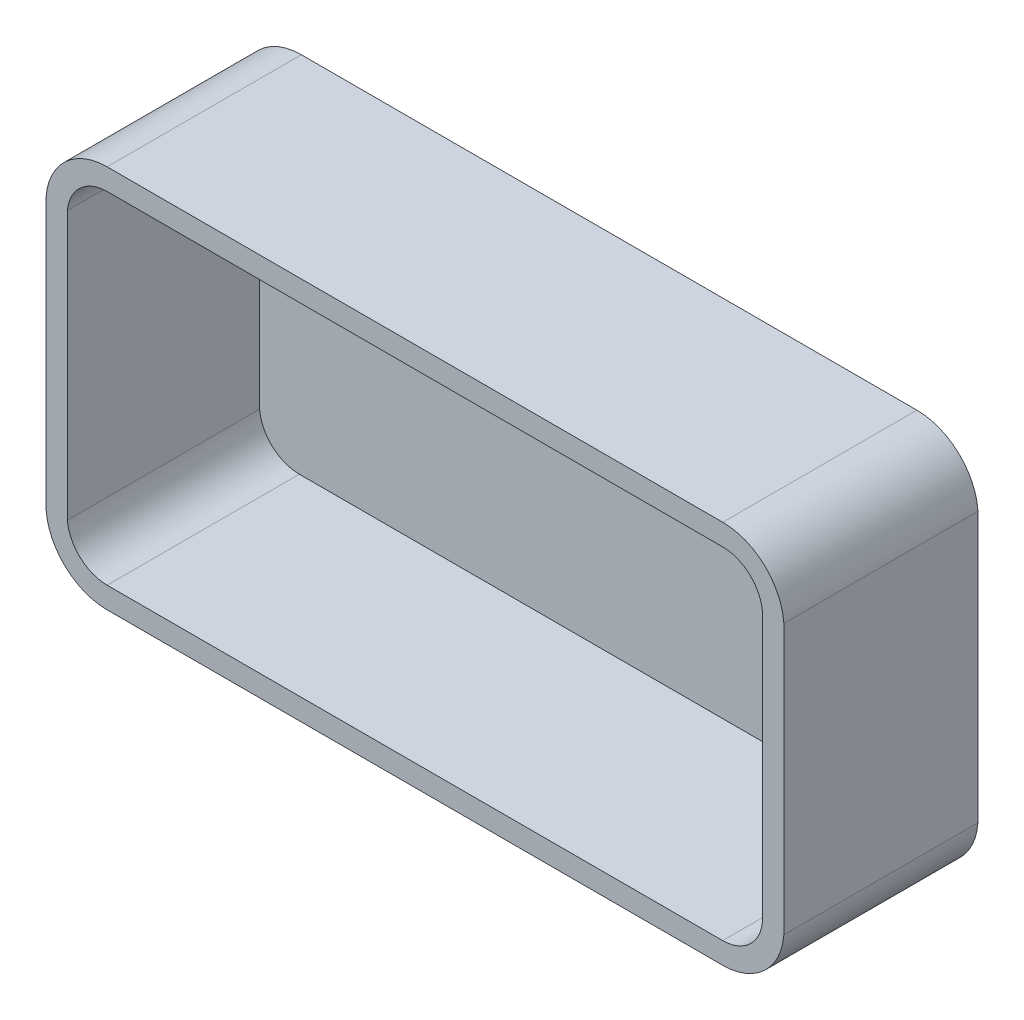
ISO-10303-21;
HEADER;
FILE_DESCRIPTION(('STEP AP214'),'2;1');
FILE_NAME('part.step','',(''),(''),'','','');
FILE_SCHEMA(('AUTOMOTIVE_DESIGN { 1 0 10303 214 1 1 1 1 }'));
ENDSEC;
DATA;
#1=APPLICATION_CONTEXT('core data for automotive mechanical design processes');
#2=APPLICATION_PROTOCOL_DEFINITION('international standard','automotive_design',2000,#1);
#3=PRODUCT_CONTEXT('',#1,'mechanical');
#4=PRODUCT('Part','Part','',(#3));
#5=PRODUCT_RELATED_PRODUCT_CATEGORY('part','',(#4));
#6=PRODUCT_DEFINITION_FORMATION('','',#4);
#7=PRODUCT_DEFINITION_CONTEXT('part definition',#1,'design');
#8=PRODUCT_DEFINITION('design','',#6,#7);
#9=PRODUCT_DEFINITION_SHAPE('','',#8);
#10=(LENGTH_UNIT() NAMED_UNIT(*) SI_UNIT(.MILLI.,.METRE.));
#11=(NAMED_UNIT(*) PLANE_ANGLE_UNIT() SI_UNIT($,.RADIAN.));
#12=(NAMED_UNIT(*) SI_UNIT($,.STERADIAN.) SOLID_ANGLE_UNIT());
#13=UNCERTAINTY_MEASURE_WITH_UNIT(LENGTH_MEASURE(1.E-05),#10,'distance_accuracy_value','');
#14=(GEOMETRIC_REPRESENTATION_CONTEXT(3) GLOBAL_UNCERTAINTY_ASSIGNED_CONTEXT((#13)) GLOBAL_UNIT_ASSIGNED_CONTEXT((#10,
#11,#12)) REPRESENTATION_CONTEXT('',''));
#15=CARTESIAN_POINT('',(0.,0.,0.));
#16=DIRECTION('',(0.,0.,1.));
#17=DIRECTION('',(1.,0.,0.));
#18=AXIS2_PLACEMENT_3D('',#15,#16,#17);
#19=CARTESIAN_POINT('',(5219.30963149017,315.598663005318,1000.));
#20=DIRECTION('',(0.,0.,-1.));
#21=DIRECTION('',(-1.,0.,0.));
#22=AXIS2_PLACEMENT_3D('',#19,#20,#21);
#23=PLANE('',#22);
#24=CARTESIAN_POINT('',(5219.30963149017,315.598663005318,1000.));
#25=DIRECTION('',(0.,0.,1.));
#26=DIRECTION('',(-1.,0.,0.));
#27=AXIS2_PLACEMENT_3D('',#24,#25,#26);
#28=CIRCLE('',#27,315.598663005312);
#29=CARTESIAN_POINT('',(4904.50700095543,293.197326010624,1000.));
#30=VERTEX_POINT('',#29);
#31=CARTESIAN_POINT('',(5219.30963149017,5.77315972805081E-12,1000.));
#32=VERTEX_POINT('',#31);
#33=EDGE_CURVE('E218',#30,#32,#28,.T.);
#34=ORIENTED_EDGE('',*,*,#33,.T.);
#35=DIRECTION('',(1.,0.,0.));
#36=VECTOR('',#35,1.);
#37=CARTESIAN_POINT('',(5219.30963149017,5.77315972805081E-12,1000.));
#38=LINE('',#37,#36);
#39=CARTESIAN_POINT('',(8389.70437042069,0.,1000.));
#40=VERTEX_POINT('',#39);
#41=EDGE_CURVE('E221',#32,#40,#38,.T.);
#42=ORIENTED_EDGE('',*,*,#41,.T.);
#43=CARTESIAN_POINT('',(8389.70437042069,315.598663005312,1000.));
#44=DIRECTION('',(0.,0.,1.));
#45=DIRECTION('',(1.,0.,0.));
#46=AXIS2_PLACEMENT_3D('',#43,#44,#45);
#47=CIRCLE('',#46,315.598663005312);
#48=CARTESIAN_POINT('',(8704.50700095543,293.197326010618,1000.));
#49=VERTEX_POINT('',#48);
#50=EDGE_CURVE('E224',#40,#49,#47,.T.);
#51=ORIENTED_EDGE('',*,*,#50,.T.);
#52=DIRECTION('',(0.,1.,0.));
#53=VECTOR('',#52,1.);
#54=CARTESIAN_POINT('',(8704.50700095543,1682.80267398938,1000.));
#55=LINE('',#54,#53);
#56=CARTESIAN_POINT('',(8704.50700095543,1682.80267398938,1000.));
#57=VERTEX_POINT('',#56);
#58=EDGE_CURVE('E226',#49,#57,#55,.T.);
#59=ORIENTED_EDGE('',*,*,#58,.T.);
#60=CARTESIAN_POINT('',(8389.70437042069,1660.40133699469,1000.));
#61=DIRECTION('',(0.,0.,1.));
#62=DIRECTION('',(-1.,0.,0.));
#63=AXIS2_PLACEMENT_3D('',#60,#61,#62);
#64=CIRCLE('',#63,315.598663005312);
#65=CARTESIAN_POINT('',(8389.70437042069,1976.,1000.));
#66=VERTEX_POINT('',#65);
#67=EDGE_CURVE('E228',#57,#66,#64,.T.);
#68=ORIENTED_EDGE('',*,*,#67,.T.);
#69=DIRECTION('',(-1.,0.,0.));
#70=VECTOR('',#69,1.);
#71=CARTESIAN_POINT('',(5219.30963149017,1976.00000000001,1000.));
#72=LINE('',#71,#70);
#73=CARTESIAN_POINT('',(5219.30963149017,1976.00000000001,1000.));
#74=VERTEX_POINT('',#73);
#75=EDGE_CURVE('E230',#66,#74,#72,.T.);
#76=ORIENTED_EDGE('',*,*,#75,.T.);
#77=CARTESIAN_POINT('',(5219.30963149017,1660.40133699469,1000.));
#78=DIRECTION('',(0.,0.,1.));
#79=DIRECTION('',(1.,0.,0.));
#80=AXIS2_PLACEMENT_3D('',#77,#78,#79);
#81=CIRCLE('',#80,315.598663005312);
#82=CARTESIAN_POINT('',(4904.50700095543,1682.80267398939,1000.));
#83=VERTEX_POINT('',#82);
#84=EDGE_CURVE('E232',#74,#83,#81,.T.);
#85=ORIENTED_EDGE('',*,*,#84,.T.);
#86=DIRECTION('',(0.,-1.,0.));
#87=VECTOR('',#86,1.);
#88=CARTESIAN_POINT('',(4904.50700095543,1682.80267398939,1000.));
#89=LINE('',#88,#87);
#90=EDGE_CURVE('E234',#83,#30,#89,.T.);
#91=ORIENTED_EDGE('',*,*,#90,.T.);
#92=EDGE_LOOP('',(#34,#42,#51,#59,#68,#76,#85,#91));
#93=FACE_BOUND('',#92,.T.);
#94=CARTESIAN_POINT('',(5219.30963149017,315.598663005318,1000.));
#95=DIRECTION('',(0.,0.,1.));
#96=DIRECTION('',(-1.,0.,0.));
#97=AXIS2_PLACEMENT_3D('',#94,#95,#96);
#98=CIRCLE('',#97,205.598663005312);
#99=CARTESIAN_POINT('',(5014.50700095543,297.524019008111,1000.));
#100=VERTEX_POINT('',#99);
#101=CARTESIAN_POINT('',(5219.30963149017,110.000000000006,1000.));
#102=VERTEX_POINT('',#101);
#103=EDGE_CURVE('E167',#100,#102,#98,.T.);
#104=ORIENTED_EDGE('',*,*,#103,.F.);
#105=DIRECTION('',(0.,-1.,0.));
#106=VECTOR('',#105,1.);
#107=CARTESIAN_POINT('',(5014.50700095543,1678.47598099185,1000.));
#108=LINE('',#107,#106);
#109=CARTESIAN_POINT('',(5014.50700095543,1678.47598099185,1000.));
#110=VERTEX_POINT('',#109);
#111=EDGE_CURVE('E157',#110,#100,#108,.T.);
#112=ORIENTED_EDGE('',*,*,#111,.F.);
#113=CARTESIAN_POINT('',(5219.30963149017,1660.40133699469,1000.));
#114=DIRECTION('',(0.,0.,1.));
#115=DIRECTION('',(1.,0.,0.));
#116=AXIS2_PLACEMENT_3D('',#113,#114,#115);
#117=CIRCLE('',#116,205.598663005312);
#118=CARTESIAN_POINT('',(5219.30963149017,1866.00000000001,1000.));
#119=VERTEX_POINT('',#118);
#120=EDGE_CURVE('E199',#119,#110,#117,.T.);
#121=ORIENTED_EDGE('',*,*,#120,.F.);
#122=DIRECTION('',(-1.,0.,0.));
#123=VECTOR('',#122,1.);
#124=CARTESIAN_POINT('',(5219.30963149017,1866.00000000001,1000.));
#125=LINE('',#124,#123);
#126=CARTESIAN_POINT('',(8389.70437042069,1866.,1000.));
#127=VERTEX_POINT('',#126);
#128=EDGE_CURVE('E197',#127,#119,#125,.T.);
#129=ORIENTED_EDGE('',*,*,#128,.F.);
#130=CARTESIAN_POINT('',(8389.70437042069,1660.40133699469,1000.));
#131=DIRECTION('',(0.,0.,1.));
#132=DIRECTION('',(-1.,0.,0.));
#133=AXIS2_PLACEMENT_3D('',#130,#131,#132);
#134=CIRCLE('',#133,205.598663005312);
#135=CARTESIAN_POINT('',(8594.50700095543,1678.47598099183,1000.));
#136=VERTEX_POINT('',#135);
#137=EDGE_CURVE('E195',#136,#127,#134,.T.);
#138=ORIENTED_EDGE('',*,*,#137,.F.);
#139=DIRECTION('',(0.,1.,0.));
#140=VECTOR('',#139,1.);
#141=CARTESIAN_POINT('',(8594.50700095543,1678.47598099183,1000.));
#142=LINE('',#141,#140);
#143=CARTESIAN_POINT('',(8594.50700095543,297.524019008171,1000.));
#144=VERTEX_POINT('',#143);
#145=EDGE_CURVE('E193',#144,#136,#142,.T.);
#146=ORIENTED_EDGE('',*,*,#145,.F.);
#147=CARTESIAN_POINT('',(8389.70437042069,315.598663005312,1000.));
#148=DIRECTION('',(0.,0.,1.));
#149=DIRECTION('',(1.,0.,0.));
#150=AXIS2_PLACEMENT_3D('',#147,#148,#149);
#151=CIRCLE('',#150,205.598663005309);
#152=CARTESIAN_POINT('',(8389.70437042069,110.000000000006,1000.));
#153=VERTEX_POINT('',#152);
#154=EDGE_CURVE('E191',#153,#144,#151,.T.);
#155=ORIENTED_EDGE('',*,*,#154,.F.);
#156=DIRECTION('',(1.,0.,0.));
#157=VECTOR('',#156,1.);
#158=CARTESIAN_POINT('',(5219.30963149017,110.000000000006,1000.));
#159=LINE('',#158,#157);
#160=EDGE_CURVE('E189',#102,#153,#159,.T.);
#161=ORIENTED_EDGE('',*,*,#160,.F.);
#162=EDGE_LOOP('',(#104,#112,#121,#129,#138,#146,#155,#161));
#163=FACE_BOUND('',#162,.T.);
#164=ADVANCED_FACE('F37',(#93,#163),#23,.F.);
#165=CARTESIAN_POINT('',(5219.30963149017,315.598663005318,0.));
#166=DIRECTION('',(0.,0.,-1.));
#167=DIRECTION('',(-1.,0.,0.));
#168=AXIS2_PLACEMENT_3D('',#165,#166,#167);
#169=PLANE('',#168);
#170=CARTESIAN_POINT('',(5219.30963149017,315.598663005318,0.));
#171=DIRECTION('',(0.,0.,1.));
#172=DIRECTION('',(-1.,0.,0.));
#173=AXIS2_PLACEMENT_3D('',#170,#171,#172);
#174=CIRCLE('',#173,315.598663005312);
#175=CARTESIAN_POINT('',(4904.50700095543,293.197326010624,0.));
#176=VERTEX_POINT('',#175);
#177=CARTESIAN_POINT('',(5219.30963149017,5.77315972805081E-12,0.));
#178=VERTEX_POINT('',#177);
#179=EDGE_CURVE('E217',#176,#178,#174,.T.);
#180=ORIENTED_EDGE('',*,*,#179,.F.);
#181=DIRECTION('',(0.,-1.,0.));
#182=VECTOR('',#181,1.);
#183=CARTESIAN_POINT('',(4904.50700095543,1682.80267398939,0.));
#184=LINE('',#183,#182);
#185=CARTESIAN_POINT('',(4904.50700095543,1682.80267398939,0.));
#186=VERTEX_POINT('',#185);
#187=EDGE_CURVE('E222',#186,#176,#184,.T.);
#188=ORIENTED_EDGE('',*,*,#187,.F.);
#189=CARTESIAN_POINT('',(5219.30963149017,1660.40133699469,0.));
#190=DIRECTION('',(0.,0.,1.));
#191=DIRECTION('',(1.,0.,0.));
#192=AXIS2_PLACEMENT_3D('',#189,#190,#191);
#193=CIRCLE('',#192,315.598663005312);
#194=CARTESIAN_POINT('',(5219.30963149017,1976.00000000001,0.));
#195=VERTEX_POINT('',#194);
#196=EDGE_CURVE('E254',#195,#186,#193,.T.);
#197=ORIENTED_EDGE('',*,*,#196,.F.);
#198=DIRECTION('',(-1.,0.,0.));
#199=VECTOR('',#198,1.);
#200=CARTESIAN_POINT('',(5219.30963149017,1976.00000000001,0.));
#201=LINE('',#200,#199);
#202=CARTESIAN_POINT('',(8389.70437042069,1976.,0.));
#203=VERTEX_POINT('',#202);
#204=EDGE_CURVE('E251',#203,#195,#201,.T.);
#205=ORIENTED_EDGE('',*,*,#204,.F.);
#206=CARTESIAN_POINT('',(8389.70437042069,1660.40133699469,0.));
#207=DIRECTION('',(0.,0.,1.));
#208=DIRECTION('',(-1.,0.,0.));
#209=AXIS2_PLACEMENT_3D('',#206,#207,#208);
#210=CIRCLE('',#209,315.598663005312);
#211=CARTESIAN_POINT('',(8704.50700095543,1682.80267398938,0.));
#212=VERTEX_POINT('',#211);
#213=EDGE_CURVE('E248',#212,#203,#210,.T.);
#214=ORIENTED_EDGE('',*,*,#213,.F.);
#215=DIRECTION('',(0.,1.,0.));
#216=VECTOR('',#215,1.);
#217=CARTESIAN_POINT('',(8704.50700095543,1682.80267398938,0.));
#218=LINE('',#217,#216);
#219=CARTESIAN_POINT('',(8704.50700095543,293.197326010618,0.));
#220=VERTEX_POINT('',#219);
#221=EDGE_CURVE('E245',#220,#212,#218,.T.);
#222=ORIENTED_EDGE('',*,*,#221,.F.);
#223=CARTESIAN_POINT('',(8389.70437042069,315.598663005312,0.));
#224=DIRECTION('',(0.,0.,1.));
#225=DIRECTION('',(1.,0.,0.));
#226=AXIS2_PLACEMENT_3D('',#223,#224,#225);
#227=CIRCLE('',#226,315.598663005312);
#228=CARTESIAN_POINT('',(8389.70437042069,0.,0.));
#229=VERTEX_POINT('',#228);
#230=EDGE_CURVE('E242',#229,#220,#227,.T.);
#231=ORIENTED_EDGE('',*,*,#230,.F.);
#232=DIRECTION('',(1.,0.,0.));
#233=VECTOR('',#232,1.);
#234=CARTESIAN_POINT('',(5219.30963149017,5.77315972805081E-12,0.));
#235=LINE('',#234,#233);
#236=EDGE_CURVE('E239',#178,#229,#235,.T.);
#237=ORIENTED_EDGE('',*,*,#236,.F.);
#238=EDGE_LOOP('',(#180,#188,#197,#205,#214,#222,#231,#237));
#239=FACE_BOUND('',#238,.T.);
#240=ADVANCED_FACE('F281',(#239),#169,.T.);
#241=CARTESIAN_POINT('',(5219.30963149017,315.598663005318,1000.));
#242=DIRECTION('',(0.,0.,-1.));
#243=DIRECTION('',(-1.,0.,0.));
#244=AXIS2_PLACEMENT_3D('',#241,#242,#243);
#245=CYLINDRICAL_SURFACE('',#244,315.598663005312);
#246=DIRECTION('',(0.,0.,-1.));
#247=VECTOR('',#246,1.);
#248=CARTESIAN_POINT('',(4904.50700095543,293.197326010624,1000.));
#249=LINE('',#248,#247);
#250=EDGE_CURVE('E236',#30,#176,#249,.T.);
#251=ORIENTED_EDGE('',*,*,#250,.T.);
#252=ORIENTED_EDGE('',*,*,#179,.T.);
#253=DIRECTION('',(0.,0.,-1.));
#254=VECTOR('',#253,1.);
#255=CARTESIAN_POINT('',(5219.30963149017,5.77315972805081E-12,1000.));
#256=LINE('',#255,#254);
#257=EDGE_CURVE('E45',#32,#178,#256,.T.);
#258=ORIENTED_EDGE('',*,*,#257,.F.);
#259=ORIENTED_EDGE('',*,*,#33,.F.);
#260=EDGE_LOOP('',(#251,#252,#258,#259));
#261=FACE_BOUND('',#260,.T.);
#262=ADVANCED_FACE('F39',(#261),#245,.T.);
#263=CARTESIAN_POINT('',(5219.30963149017,5.77315972805081E-12,1000.));
#264=DIRECTION('',(0.,1.,0.));
#265=DIRECTION('',(-1.,0.,0.));
#266=AXIS2_PLACEMENT_3D('',#263,#264,#265);
#267=PLANE('',#266);
#268=ORIENTED_EDGE('',*,*,#257,.T.);
#269=ORIENTED_EDGE('',*,*,#236,.T.);
#270=DIRECTION('',(0.,0.,-1.));
#271=VECTOR('',#270,1.);
#272=CARTESIAN_POINT('',(8389.70437042069,0.,1000.));
#273=LINE('',#272,#271);
#274=EDGE_CURVE('E270',#40,#229,#273,.T.);
#275=ORIENTED_EDGE('',*,*,#274,.F.);
#276=ORIENTED_EDGE('',*,*,#41,.F.);
#277=EDGE_LOOP('',(#268,#269,#275,#276));
#278=FACE_BOUND('',#277,.T.);
#279=ADVANCED_FACE('F274',(#278),#267,.F.);
#280=CARTESIAN_POINT('',(8389.70437042069,315.598663005312,1000.));
#281=DIRECTION('',(0.,0.,-1.));
#282=DIRECTION('',(-1.,0.,0.));
#283=AXIS2_PLACEMENT_3D('',#280,#281,#282);
#284=CYLINDRICAL_SURFACE('',#283,315.598663005312);
#285=ORIENTED_EDGE('',*,*,#274,.T.);
#286=ORIENTED_EDGE('',*,*,#230,.T.);
#287=DIRECTION('',(0.,0.,-1.));
#288=VECTOR('',#287,1.);
#289=CARTESIAN_POINT('',(8704.50700095543,293.197326010618,1000.));
#290=LINE('',#289,#288);
#291=EDGE_CURVE('E268',#49,#220,#290,.T.);
#292=ORIENTED_EDGE('',*,*,#291,.F.);
#293=ORIENTED_EDGE('',*,*,#50,.F.);
#294=EDGE_LOOP('',(#285,#286,#292,#293));
#295=FACE_BOUND('',#294,.T.);
#296=ADVANCED_FACE('F310',(#295),#284,.T.);
#297=CARTESIAN_POINT('',(8704.50700095543,1682.80267398938,1000.));
#298=DIRECTION('',(-1.,0.,0.));
#299=DIRECTION('',(0.,0.,1.));
#300=AXIS2_PLACEMENT_3D('',#297,#298,#299);
#301=PLANE('',#300);
#302=ORIENTED_EDGE('',*,*,#291,.T.);
#303=ORIENTED_EDGE('',*,*,#221,.T.);
#304=DIRECTION('',(0.,0.,-1.));
#305=VECTOR('',#304,1.);
#306=CARTESIAN_POINT('',(8704.50700095543,1682.80267398938,1000.));
#307=LINE('',#306,#305);
#308=EDGE_CURVE('E266',#57,#212,#307,.T.);
#309=ORIENTED_EDGE('',*,*,#308,.F.);
#310=ORIENTED_EDGE('',*,*,#58,.F.);
#311=EDGE_LOOP('',(#302,#303,#309,#310));
#312=FACE_BOUND('',#311,.T.);
#313=ADVANCED_FACE('F305',(#312),#301,.F.);
#314=CARTESIAN_POINT('',(8389.70437042069,1660.40133699469,1000.));
#315=DIRECTION('',(0.,0.,-1.));
#316=DIRECTION('',(-1.,0.,0.));
#317=AXIS2_PLACEMENT_3D('',#314,#315,#316);
#318=CYLINDRICAL_SURFACE('',#317,315.598663005312);
#319=ORIENTED_EDGE('',*,*,#308,.T.);
#320=ORIENTED_EDGE('',*,*,#213,.T.);
#321=DIRECTION('',(0.,0.,-1.));
#322=VECTOR('',#321,1.);
#323=CARTESIAN_POINT('',(8389.70437042069,1976.,1000.));
#324=LINE('',#323,#322);
#325=EDGE_CURVE('E264',#66,#203,#324,.T.);
#326=ORIENTED_EDGE('',*,*,#325,.F.);
#327=ORIENTED_EDGE('',*,*,#67,.F.);
#328=EDGE_LOOP('',(#319,#320,#326,#327));
#329=FACE_BOUND('',#328,.T.);
#330=ADVANCED_FACE('F302',(#329),#318,.T.);
#331=CARTESIAN_POINT('',(5219.30963149017,1976.00000000001,1000.));
#332=DIRECTION('',(0.,-1.,0.));
#333=DIRECTION('',(1.,0.,0.));
#334=AXIS2_PLACEMENT_3D('',#331,#332,#333);
#335=PLANE('',#334);
#336=ORIENTED_EDGE('',*,*,#325,.T.);
#337=ORIENTED_EDGE('',*,*,#204,.T.);
#338=DIRECTION('',(0.,0.,-1.));
#339=VECTOR('',#338,1.);
#340=CARTESIAN_POINT('',(5219.30963149017,1976.00000000001,1000.));
#341=LINE('',#340,#339);
#342=EDGE_CURVE('E262',#74,#195,#341,.T.);
#343=ORIENTED_EDGE('',*,*,#342,.F.);
#344=ORIENTED_EDGE('',*,*,#75,.F.);
#345=EDGE_LOOP('',(#336,#337,#343,#344));
#346=FACE_BOUND('',#345,.T.);
#347=ADVANCED_FACE('F298',(#346),#335,.F.);
#348=CARTESIAN_POINT('',(5219.30963149017,1660.40133699469,1000.));
#349=DIRECTION('',(0.,0.,-1.));
#350=DIRECTION('',(-1.,0.,0.));
#351=AXIS2_PLACEMENT_3D('',#348,#349,#350);
#352=CYLINDRICAL_SURFACE('',#351,315.598663005312);
#353=ORIENTED_EDGE('',*,*,#342,.T.);
#354=ORIENTED_EDGE('',*,*,#196,.T.);
#355=DIRECTION('',(0.,0.,-1.));
#356=VECTOR('',#355,1.);
#357=CARTESIAN_POINT('',(4904.50700095543,1682.80267398939,1000.));
#358=LINE('',#357,#356);
#359=EDGE_CURVE('E260',#83,#186,#358,.T.);
#360=ORIENTED_EDGE('',*,*,#359,.F.);
#361=ORIENTED_EDGE('',*,*,#84,.F.);
#362=EDGE_LOOP('',(#353,#354,#360,#361));
#363=FACE_BOUND('',#362,.T.);
#364=ADVANCED_FACE('F293',(#363),#352,.T.);
#365=CARTESIAN_POINT('',(4904.50700095543,1682.80267398939,1000.));
#366=DIRECTION('',(1.,0.,0.));
#367=DIRECTION('',(0.,1.,0.));
#368=AXIS2_PLACEMENT_3D('',#365,#366,#367);
#369=PLANE('',#368);
#370=ORIENTED_EDGE('',*,*,#359,.T.);
#371=ORIENTED_EDGE('',*,*,#187,.T.);
#372=ORIENTED_EDGE('',*,*,#250,.F.);
#373=ORIENTED_EDGE('',*,*,#90,.F.);
#374=EDGE_LOOP('',(#370,#371,#372,#373));
#375=FACE_BOUND('',#374,.T.);
#376=ADVANCED_FACE('F287',(#375),#369,.F.);
#377=CARTESIAN_POINT('',(5219.30963149017,315.598663005318,1000.));
#378=DIRECTION('',(0.,0.,-1.));
#379=DIRECTION('',(-1.,0.,0.));
#380=AXIS2_PLACEMENT_3D('',#377,#378,#379);
#381=CYLINDRICAL_SURFACE('',#380,205.598663005312);
#382=CARTESIAN_POINT('',(5219.30963149017,315.598663005318,10.));
#383=DIRECTION('',(0.,0.,1.));
#384=DIRECTION('',(1.,0.,0.));
#385=AXIS2_PLACEMENT_3D('',#382,#383,#384);
#386=CIRCLE('',#385,205.598663005312);
#387=CARTESIAN_POINT('',(5014.50700095543,297.524019008111,10.));
#388=VERTEX_POINT('',#387);
#389=CARTESIAN_POINT('',(5219.30963149017,110.000000000006,10.));
#390=VERTEX_POINT('',#389);
#391=EDGE_CURVE('E163',#388,#390,#386,.T.);
#392=ORIENTED_EDGE('',*,*,#391,.F.);
#393=DIRECTION('',(0.,0.,-1.));
#394=VECTOR('',#393,1.);
#395=CARTESIAN_POINT('',(5014.50700095543,297.524019008111,1000.));
#396=LINE('',#395,#394);
#397=EDGE_CURVE('E152',#100,#388,#396,.T.);
#398=ORIENTED_EDGE('',*,*,#397,.F.);
#399=ORIENTED_EDGE('',*,*,#103,.T.);
#400=DIRECTION('',(0.,0.,-1.));
#401=VECTOR('',#400,1.);
#402=CARTESIAN_POINT('',(5219.30963149017,110.000000000006,1000.));
#403=LINE('',#402,#401);
#404=EDGE_CURVE('E165',#102,#390,#403,.T.);
#405=ORIENTED_EDGE('',*,*,#404,.T.);
#406=EDGE_LOOP('',(#392,#398,#399,#405));
#407=FACE_BOUND('',#406,.T.);
#408=ADVANCED_FACE('F164',(#407),#381,.F.);
#409=CARTESIAN_POINT('',(5219.30963149017,110.000000000006,1000.));
#410=DIRECTION('',(0.,1.,0.));
#411=DIRECTION('',(0.,0.,1.));
#412=AXIS2_PLACEMENT_3D('',#409,#410,#411);
#413=PLANE('',#412);
#414=DIRECTION('',(1.,0.,0.));
#415=VECTOR('',#414,1.);
#416=CARTESIAN_POINT('',(5219.30963149017,110.000000000006,10.));
#417=LINE('',#416,#415);
#418=CARTESIAN_POINT('',(8389.70437042069,110.000000000006,10.));
#419=VERTEX_POINT('',#418);
#420=EDGE_CURVE('E52',#390,#419,#417,.T.);
#421=ORIENTED_EDGE('',*,*,#420,.F.);
#422=ORIENTED_EDGE('',*,*,#404,.F.);
#423=ORIENTED_EDGE('',*,*,#160,.T.);
#424=DIRECTION('',(0.,0.,-1.));
#425=VECTOR('',#424,1.);
#426=CARTESIAN_POINT('',(8389.70437042069,110.000000000006,1000.));
#427=LINE('',#426,#425);
#428=EDGE_CURVE('E214',#153,#419,#427,.T.);
#429=ORIENTED_EDGE('',*,*,#428,.T.);
#430=EDGE_LOOP('',(#421,#422,#423,#429));
#431=FACE_BOUND('',#430,.T.);
#432=ADVANCED_FACE('F318',(#431),#413,.T.);
#433=CARTESIAN_POINT('',(8389.70437042069,315.598663005312,1000.));
#434=DIRECTION('',(0.,0.,-1.));
#435=DIRECTION('',(-1.,0.,0.));
#436=AXIS2_PLACEMENT_3D('',#433,#434,#435);
#437=CYLINDRICAL_SURFACE('',#436,205.598663005309);
#438=CARTESIAN_POINT('',(8389.70437042069,315.598663005312,10.));
#439=DIRECTION('',(0.,0.,1.));
#440=DIRECTION('',(1.,0.,0.));
#441=AXIS2_PLACEMENT_3D('',#438,#439,#440);
#442=CIRCLE('',#441,205.598663005309);
#443=CARTESIAN_POINT('',(8594.50700095543,297.524019008171,10.));
#444=VERTEX_POINT('',#443);
#445=EDGE_CURVE('E60',#419,#444,#442,.T.);
#446=ORIENTED_EDGE('',*,*,#445,.F.);
#447=ORIENTED_EDGE('',*,*,#428,.F.);
#448=ORIENTED_EDGE('',*,*,#154,.T.);
#449=DIRECTION('',(0.,0.,-1.));
#450=VECTOR('',#449,1.);
#451=CARTESIAN_POINT('',(8594.50700095543,297.524019008171,1000.));
#452=LINE('',#451,#450);
#453=EDGE_CURVE('E212',#144,#444,#452,.T.);
#454=ORIENTED_EDGE('',*,*,#453,.T.);
#455=EDGE_LOOP('',(#446,#447,#448,#454));
#456=FACE_BOUND('',#455,.T.);
#457=ADVANCED_FACE('F319',(#456),#437,.F.);
#458=CARTESIAN_POINT('',(8594.50700095543,1678.47598099183,1000.));
#459=DIRECTION('',(-1.,0.,0.));
#460=DIRECTION('',(0.,0.,1.));
#461=AXIS2_PLACEMENT_3D('',#458,#459,#460);
#462=PLANE('',#461);
#463=DIRECTION('',(0.,1.,0.));
#464=VECTOR('',#463,1.);
#465=CARTESIAN_POINT('',(8594.50700095543,1678.47598099183,10.));
#466=LINE('',#465,#464);
#467=CARTESIAN_POINT('',(8594.50700095543,1678.47598099183,10.));
#468=VERTEX_POINT('',#467);
#469=EDGE_CURVE('E183',#444,#468,#466,.T.);
#470=ORIENTED_EDGE('',*,*,#469,.F.);
#471=ORIENTED_EDGE('',*,*,#453,.F.);
#472=ORIENTED_EDGE('',*,*,#145,.T.);
#473=DIRECTION('',(0.,0.,-1.));
#474=VECTOR('',#473,1.);
#475=CARTESIAN_POINT('',(8594.50700095543,1678.47598099183,1000.));
#476=LINE('',#475,#474);
#477=EDGE_CURVE('E209',#136,#468,#476,.T.);
#478=ORIENTED_EDGE('',*,*,#477,.T.);
#479=EDGE_LOOP('',(#470,#471,#472,#478));
#480=FACE_BOUND('',#479,.T.);
#481=ADVANCED_FACE('F326',(#480),#462,.T.);
#482=CARTESIAN_POINT('',(8389.70437042069,1660.40133699469,1000.));
#483=DIRECTION('',(0.,0.,-1.));
#484=DIRECTION('',(-1.,0.,0.));
#485=AXIS2_PLACEMENT_3D('',#482,#483,#484);
#486=CYLINDRICAL_SURFACE('',#485,205.598663005312);
#487=CARTESIAN_POINT('',(8389.70437042069,1660.40133699469,10.));
#488=DIRECTION('',(0.,0.,1.));
#489=DIRECTION('',(1.,0.,0.));
#490=AXIS2_PLACEMENT_3D('',#487,#488,#489);
#491=CIRCLE('',#490,205.598663005312);
#492=CARTESIAN_POINT('',(8389.70437042069,1866.,10.));
#493=VERTEX_POINT('',#492);
#494=EDGE_CURVE('E179',#468,#493,#491,.T.);
#495=ORIENTED_EDGE('',*,*,#494,.F.);
#496=ORIENTED_EDGE('',*,*,#477,.F.);
#497=ORIENTED_EDGE('',*,*,#137,.T.);
#498=DIRECTION('',(0.,0.,-1.));
#499=VECTOR('',#498,1.);
#500=CARTESIAN_POINT('',(8389.70437042069,1866.,1000.));
#501=LINE('',#500,#499);
#502=EDGE_CURVE('E206',#127,#493,#501,.T.);
#503=ORIENTED_EDGE('',*,*,#502,.T.);
#504=EDGE_LOOP('',(#495,#496,#497,#503));
#505=FACE_BOUND('',#504,.T.);
#506=ADVANCED_FACE('F328',(#505),#486,.F.);
#507=CARTESIAN_POINT('',(5219.30963149017,1866.00000000001,1000.));
#508=DIRECTION('',(0.,-1.,0.));
#509=DIRECTION('',(1.,0.,0.));
#510=AXIS2_PLACEMENT_3D('',#507,#508,#509);
#511=PLANE('',#510);
#512=DIRECTION('',(-1.,0.,0.));
#513=VECTOR('',#512,1.);
#514=CARTESIAN_POINT('',(5219.30963149017,1866.00000000001,10.));
#515=LINE('',#514,#513);
#516=CARTESIAN_POINT('',(5219.30963149017,1866.00000000001,10.));
#517=VERTEX_POINT('',#516);
#518=EDGE_CURVE('E174',#493,#517,#515,.T.);
#519=ORIENTED_EDGE('',*,*,#518,.F.);
#520=ORIENTED_EDGE('',*,*,#502,.F.);
#521=ORIENTED_EDGE('',*,*,#128,.T.);
#522=DIRECTION('',(0.,0.,-1.));
#523=VECTOR('',#522,1.);
#524=CARTESIAN_POINT('',(5219.30963149017,1866.00000000001,1000.));
#525=LINE('',#524,#523);
#526=EDGE_CURVE('E204',#119,#517,#525,.T.);
#527=ORIENTED_EDGE('',*,*,#526,.T.);
#528=EDGE_LOOP('',(#519,#520,#521,#527));
#529=FACE_BOUND('',#528,.T.);
#530=ADVANCED_FACE('F331',(#529),#511,.T.);
#531=CARTESIAN_POINT('',(5219.30963149017,1660.40133699469,1000.));
#532=DIRECTION('',(0.,0.,-1.));
#533=DIRECTION('',(-1.,0.,0.));
#534=AXIS2_PLACEMENT_3D('',#531,#532,#533);
#535=CYLINDRICAL_SURFACE('',#534,205.598663005312);
#536=CARTESIAN_POINT('',(5219.30963149017,1660.40133699469,10.));
#537=DIRECTION('',(0.,0.,1.));
#538=DIRECTION('',(1.,0.,0.));
#539=AXIS2_PLACEMENT_3D('',#536,#537,#538);
#540=CIRCLE('',#539,205.598663005312);
#541=CARTESIAN_POINT('',(5014.50700095543,1678.47598099185,10.));
#542=VERTEX_POINT('',#541);
#543=EDGE_CURVE('E172',#517,#542,#540,.T.);
#544=ORIENTED_EDGE('',*,*,#543,.F.);
#545=ORIENTED_EDGE('',*,*,#526,.F.);
#546=ORIENTED_EDGE('',*,*,#120,.T.);
#547=DIRECTION('',(0.,0.,-1.));
#548=VECTOR('',#547,1.);
#549=CARTESIAN_POINT('',(5014.50700095543,1678.47598099185,1000.));
#550=LINE('',#549,#548);
#551=EDGE_CURVE('E160',#110,#542,#550,.T.);
#552=ORIENTED_EDGE('',*,*,#551,.T.);
#553=EDGE_LOOP('',(#544,#545,#546,#552));
#554=FACE_BOUND('',#553,.T.);
#555=ADVANCED_FACE('F332',(#554),#535,.F.);
#556=CARTESIAN_POINT('',(5014.50700095543,1678.47598099185,1000.));
#557=DIRECTION('',(1.,0.,0.));
#558=DIRECTION('',(0.,0.,-1.));
#559=AXIS2_PLACEMENT_3D('',#556,#557,#558);
#560=PLANE('',#559);
#561=DIRECTION('',(0.,-1.,0.));
#562=VECTOR('',#561,1.);
#563=CARTESIAN_POINT('',(5014.50700095543,1678.47598099185,10.));
#564=LINE('',#563,#562);
#565=EDGE_CURVE('E11',#542,#388,#564,.T.);
#566=ORIENTED_EDGE('',*,*,#565,.F.);
#567=ORIENTED_EDGE('',*,*,#551,.F.);
#568=ORIENTED_EDGE('',*,*,#111,.T.);
#569=ORIENTED_EDGE('',*,*,#397,.T.);
#570=EDGE_LOOP('',(#566,#567,#568,#569));
#571=FACE_BOUND('',#570,.T.);
#572=ADVANCED_FACE('F154',(#571),#560,.T.);
#573=CARTESIAN_POINT('',(5219.30963149017,1660.40133699469,10.));
#574=DIRECTION('',(0.,0.,1.));
#575=DIRECTION('',(1.,0.,0.));
#576=AXIS2_PLACEMENT_3D('',#573,#574,#575);
#577=PLANE('',#576);
#578=ORIENTED_EDGE('',*,*,#565,.T.);
#579=ORIENTED_EDGE('',*,*,#391,.T.);
#580=ORIENTED_EDGE('',*,*,#420,.T.);
#581=ORIENTED_EDGE('',*,*,#445,.T.);
#582=ORIENTED_EDGE('',*,*,#469,.T.);
#583=ORIENTED_EDGE('',*,*,#494,.T.);
#584=ORIENTED_EDGE('',*,*,#518,.T.);
#585=ORIENTED_EDGE('',*,*,#543,.T.);
#586=EDGE_LOOP('',(#578,#579,#580,#581,#582,#583,#584,#585));
#587=FACE_BOUND('',#586,.T.);
#588=ADVANCED_FACE('F170',(#587),#577,.T.);
#589=CLOSED_SHELL('',(#164,#240,#262,#279,#296,#313,#330,#347,#364,#376,#408,#432,#457,#481,
#506,#530,#555,#572,#588));
#590=MANIFOLD_SOLID_BREP('B2',#589);
#591=ADVANCED_BREP_SHAPE_REPRESENTATION('',(#18,#590),#14);
#592=SHAPE_DEFINITION_REPRESENTATION(#9,#591);
ENDSEC;
END-ISO-10303-21;
